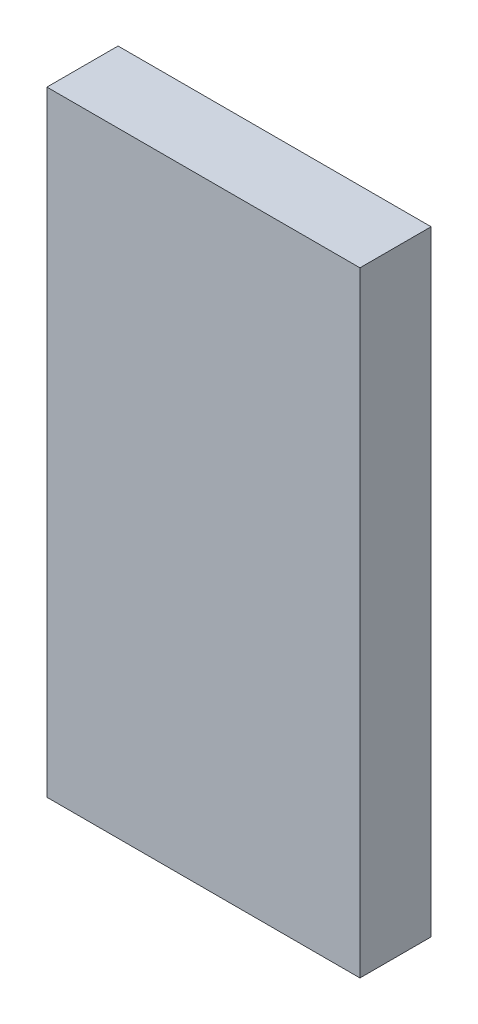
ISO-10303-21;
HEADER;
FILE_DESCRIPTION(('STEP AP214'),'2;1');
FILE_NAME('part.step','',(''),(''),'','','');
FILE_SCHEMA(('AUTOMOTIVE_DESIGN { 1 0 10303 214 1 1 1 1 }'));
ENDSEC;
DATA;
#1=APPLICATION_CONTEXT('core data for automotive mechanical design processes');
#2=APPLICATION_PROTOCOL_DEFINITION('international standard','automotive_design',2000,#1);
#3=PRODUCT_CONTEXT('',#1,'mechanical');
#4=PRODUCT('Part','Part','',(#3));
#5=PRODUCT_RELATED_PRODUCT_CATEGORY('part','',(#4));
#6=PRODUCT_DEFINITION_FORMATION('','',#4);
#7=PRODUCT_DEFINITION_CONTEXT('part definition',#1,'design');
#8=PRODUCT_DEFINITION('design','',#6,#7);
#9=PRODUCT_DEFINITION_SHAPE('','',#8);
#10=(LENGTH_UNIT() NAMED_UNIT(*) SI_UNIT(.MILLI.,.METRE.));
#11=(NAMED_UNIT(*) PLANE_ANGLE_UNIT() SI_UNIT($,.RADIAN.));
#12=(NAMED_UNIT(*) SI_UNIT($,.STERADIAN.) SOLID_ANGLE_UNIT());
#13=UNCERTAINTY_MEASURE_WITH_UNIT(LENGTH_MEASURE(1.E-05),#10,'distance_accuracy_value','');
#14=(GEOMETRIC_REPRESENTATION_CONTEXT(3) GLOBAL_UNCERTAINTY_ASSIGNED_CONTEXT((#13)) GLOBAL_UNIT_ASSIGNED_CONTEXT((#10,
#11,#12)) REPRESENTATION_CONTEXT('',''));
#15=CARTESIAN_POINT('',(0.,0.,0.));
#16=DIRECTION('',(0.,0.,1.));
#17=DIRECTION('',(1.,0.,0.));
#18=AXIS2_PLACEMENT_3D('',#15,#16,#17);
#19=CARTESIAN_POINT('',(-0.22,-2.445,0.));
#20=DIRECTION('',(1.,0.,0.));
#21=DIRECTION('',(0.,0.,1.));
#22=AXIS2_PLACEMENT_3D('',#19,#20,#21);
#23=PLANE('',#22);
#24=DIRECTION('',(0.,1.,0.));
#25=VECTOR('',#24,1.);
#26=CARTESIAN_POINT('',(-0.22,-2.445,0.1));
#27=LINE('',#26,#25);
#28=CARTESIAN_POINT('',(-0.22,-2.445,0.1));
#29=VERTEX_POINT('',#28);
#30=CARTESIAN_POINT('',(-0.22,-1.5805,0.1));
#31=VERTEX_POINT('',#30);
#32=EDGE_CURVE('E11',#29,#31,#27,.T.);
#33=ORIENTED_EDGE('',*,*,#32,.T.);
#34=DIRECTION('',(0.,0.,1.));
#35=VECTOR('',#34,1.);
#36=CARTESIAN_POINT('',(-0.22,-1.5805,0.));
#37=LINE('',#36,#35);
#38=CARTESIAN_POINT('',(-0.22,-1.5805,0.));
#39=VERTEX_POINT('',#38);
#40=EDGE_CURVE('E24',#39,#31,#37,.T.);
#41=ORIENTED_EDGE('',*,*,#40,.F.);
#42=DIRECTION('',(0.,1.,0.));
#43=VECTOR('',#42,1.);
#44=CARTESIAN_POINT('',(-0.22,-2.445,0.));
#45=LINE('',#44,#43);
#46=CARTESIAN_POINT('',(-0.22,-2.445,0.));
#47=VERTEX_POINT('',#46);
#48=EDGE_CURVE('E86',#47,#39,#45,.T.);
#49=ORIENTED_EDGE('',*,*,#48,.F.);
#50=DIRECTION('',(0.,0.,1.));
#51=VECTOR('',#50,1.);
#52=CARTESIAN_POINT('',(-0.22,-2.445,0.));
#53=LINE('',#52,#51);
#54=EDGE_CURVE('E36',#47,#29,#53,.T.);
#55=ORIENTED_EDGE('',*,*,#54,.T.);
#56=EDGE_LOOP('',(#33,#41,#49,#55));
#57=FACE_BOUND('',#56,.T.);
#58=ADVANCED_FACE('F17',(#57),#23,.F.);
#59=CARTESIAN_POINT('',(0.22,-2.445,0.));
#60=DIRECTION('',(1.,0.,0.));
#61=DIRECTION('',(0.,0.,1.));
#62=AXIS2_PLACEMENT_3D('',#59,#60,#61);
#63=PLANE('',#62);
#64=DIRECTION('',(0.,0.,1.));
#65=VECTOR('',#64,1.);
#66=CARTESIAN_POINT('',(0.22,-2.445,0.));
#67=LINE('',#66,#65);
#68=CARTESIAN_POINT('',(0.22,-2.445,0.));
#69=VERTEX_POINT('',#68);
#70=CARTESIAN_POINT('',(0.22,-2.445,0.1));
#71=VERTEX_POINT('',#70);
#72=EDGE_CURVE('E83',#69,#71,#67,.T.);
#73=ORIENTED_EDGE('',*,*,#72,.F.);
#74=DIRECTION('',(0.,1.,0.));
#75=VECTOR('',#74,1.);
#76=CARTESIAN_POINT('',(0.22,-2.445,0.));
#77=LINE('',#76,#75);
#78=CARTESIAN_POINT('',(0.22,-1.5805,0.));
#79=VERTEX_POINT('',#78);
#80=EDGE_CURVE('E63',#69,#79,#77,.T.);
#81=ORIENTED_EDGE('',*,*,#80,.T.);
#82=DIRECTION('',(0.,0.,1.));
#83=VECTOR('',#82,1.);
#84=CARTESIAN_POINT('',(0.22,-1.5805,0.));
#85=LINE('',#84,#83);
#86=CARTESIAN_POINT('',(0.22,-1.5805,0.1));
#87=VERTEX_POINT('',#86);
#88=EDGE_CURVE('E57',#79,#87,#85,.T.);
#89=ORIENTED_EDGE('',*,*,#88,.T.);
#90=DIRECTION('',(0.,1.,0.));
#91=VECTOR('',#90,1.);
#92=CARTESIAN_POINT('',(0.22,-2.445,0.1));
#93=LINE('',#92,#91);
#94=EDGE_CURVE('E60',#71,#87,#93,.T.);
#95=ORIENTED_EDGE('',*,*,#94,.F.);
#96=EDGE_LOOP('',(#73,#81,#89,#95));
#97=FACE_BOUND('',#96,.T.);
#98=ADVANCED_FACE('F59',(#97),#63,.T.);
#99=CARTESIAN_POINT('',(-0.22,-2.445,0.));
#100=DIRECTION('',(0.,1.,0.));
#101=DIRECTION('',(0.,0.,1.));
#102=AXIS2_PLACEMENT_3D('',#99,#100,#101);
#103=PLANE('',#102);
#104=ORIENTED_EDGE('',*,*,#72,.T.);
#105=DIRECTION('',(1.,0.,0.));
#106=VECTOR('',#105,1.);
#107=CARTESIAN_POINT('',(-0.22,-2.445,0.1));
#108=LINE('',#107,#106);
#109=EDGE_CURVE('E71',#29,#71,#108,.T.);
#110=ORIENTED_EDGE('',*,*,#109,.F.);
#111=ORIENTED_EDGE('',*,*,#54,.F.);
#112=DIRECTION('',(1.,0.,0.));
#113=VECTOR('',#112,1.);
#114=CARTESIAN_POINT('',(-0.22,-2.445,0.));
#115=LINE('',#114,#113);
#116=EDGE_CURVE('E76',#47,#69,#115,.T.);
#117=ORIENTED_EDGE('',*,*,#116,.T.);
#118=EDGE_LOOP('',(#104,#110,#111,#117));
#119=FACE_BOUND('',#118,.T.);
#120=ADVANCED_FACE('F91',(#119),#103,.F.);
#121=CARTESIAN_POINT('',(-0.22,-1.5805,0.));
#122=DIRECTION('',(0.,1.,0.));
#123=DIRECTION('',(0.,0.,1.));
#124=AXIS2_PLACEMENT_3D('',#121,#122,#123);
#125=PLANE('',#124);
#126=DIRECTION('',(1.,0.,0.));
#127=VECTOR('',#126,1.);
#128=CARTESIAN_POINT('',(-0.22,-1.5805,0.));
#129=LINE('',#128,#127);
#130=EDGE_CURVE('E74',#39,#79,#129,.T.);
#131=ORIENTED_EDGE('',*,*,#130,.F.);
#132=ORIENTED_EDGE('',*,*,#40,.T.);
#133=DIRECTION('',(1.,0.,0.));
#134=VECTOR('',#133,1.);
#135=CARTESIAN_POINT('',(-0.22,-1.5805,0.1));
#136=LINE('',#135,#134);
#137=EDGE_CURVE('E69',#31,#87,#136,.T.);
#138=ORIENTED_EDGE('',*,*,#137,.T.);
#139=ORIENTED_EDGE('',*,*,#88,.F.);
#140=EDGE_LOOP('',(#131,#132,#138,#139));
#141=FACE_BOUND('',#140,.T.);
#142=ADVANCED_FACE('F73',(#141),#125,.T.);
#143=CARTESIAN_POINT('',(-0.22,-2.445,0.));
#144=DIRECTION('',(0.,0.,1.));
#145=DIRECTION('',(1.,0.,0.));
#146=AXIS2_PLACEMENT_3D('',#143,#144,#145);
#147=PLANE('',#146);
#148=ORIENTED_EDGE('',*,*,#130,.T.);
#149=ORIENTED_EDGE('',*,*,#80,.F.);
#150=ORIENTED_EDGE('',*,*,#116,.F.);
#151=ORIENTED_EDGE('',*,*,#48,.T.);
#152=EDGE_LOOP('',(#148,#149,#150,#151));
#153=FACE_BOUND('',#152,.T.);
#154=ADVANCED_FACE('F89',(#153),#147,.F.);
#155=CARTESIAN_POINT('',(-0.22,-2.445,0.1));
#156=DIRECTION('',(0.,0.,1.));
#157=DIRECTION('',(1.,0.,0.));
#158=AXIS2_PLACEMENT_3D('',#155,#156,#157);
#159=PLANE('',#158);
#160=ORIENTED_EDGE('',*,*,#32,.F.);
#161=ORIENTED_EDGE('',*,*,#109,.T.);
#162=ORIENTED_EDGE('',*,*,#94,.T.);
#163=ORIENTED_EDGE('',*,*,#137,.F.);
#164=EDGE_LOOP('',(#160,#161,#162,#163));
#165=FACE_BOUND('',#164,.T.);
#166=ADVANCED_FACE('F68',(#165),#159,.T.);
#167=CLOSED_SHELL('',(#58,#98,#120,#142,#154,#166));
#168=MANIFOLD_SOLID_BREP('B1',#167);
#169=ADVANCED_BREP_SHAPE_REPRESENTATION('',(#18,#168),#14);
#170=SHAPE_DEFINITION_REPRESENTATION(#9,#169);
ENDSEC;
END-ISO-10303-21;
